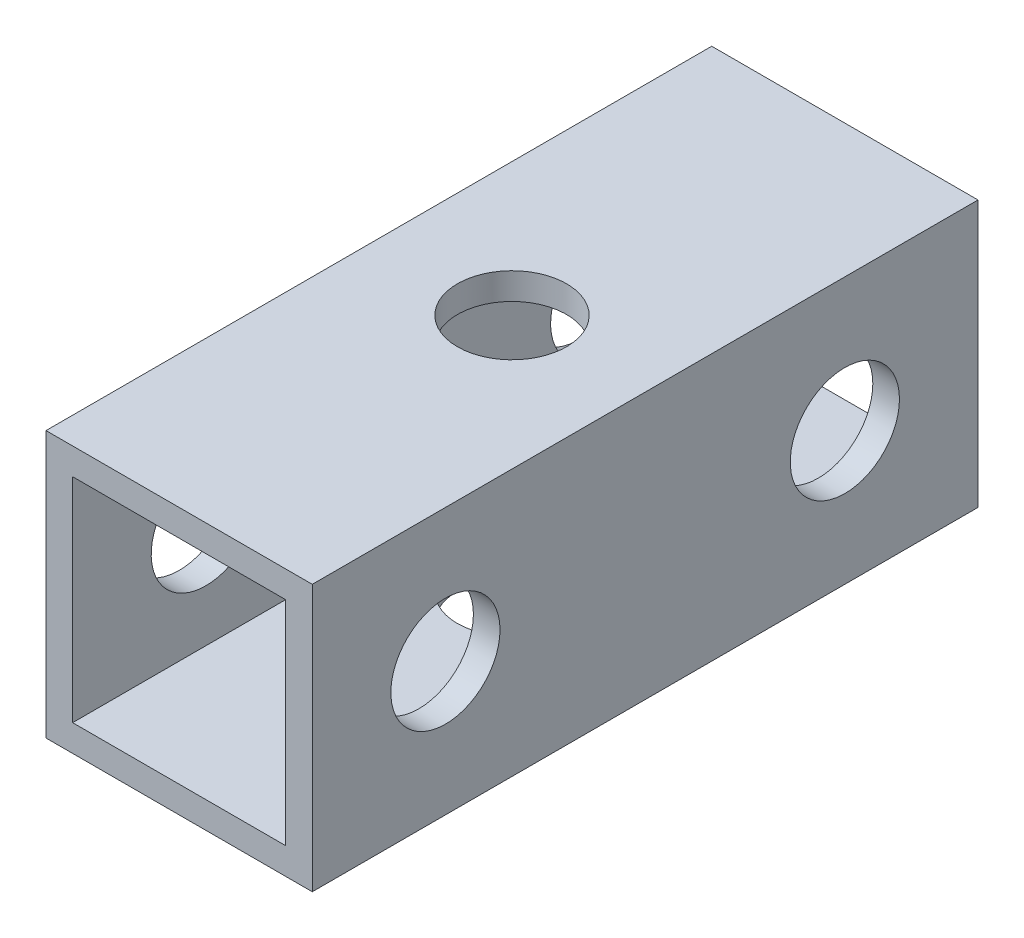
ISO-10303-21;
HEADER;
FILE_DESCRIPTION(('STEP AP214'),'2;1');
FILE_NAME('part.step','',(''),(''),'','','');
FILE_SCHEMA(('AUTOMOTIVE_DESIGN { 1 0 10303 214 1 1 1 1 }'));
ENDSEC;
DATA;
#1=APPLICATION_CONTEXT('core data for automotive mechanical design processes');
#2=APPLICATION_PROTOCOL_DEFINITION('international standard','automotive_design',2000,#1);
#3=PRODUCT_CONTEXT('',#1,'mechanical');
#4=PRODUCT('Part','Part','',(#3));
#5=PRODUCT_RELATED_PRODUCT_CATEGORY('part','',(#4));
#6=PRODUCT_DEFINITION_FORMATION('','',#4);
#7=PRODUCT_DEFINITION_CONTEXT('part definition',#1,'design');
#8=PRODUCT_DEFINITION('design','',#6,#7);
#9=PRODUCT_DEFINITION_SHAPE('','',#8);
#10=(LENGTH_UNIT() NAMED_UNIT(*) SI_UNIT(.MILLI.,.METRE.));
#11=(NAMED_UNIT(*) PLANE_ANGLE_UNIT() SI_UNIT($,.RADIAN.));
#12=(NAMED_UNIT(*) SI_UNIT($,.STERADIAN.) SOLID_ANGLE_UNIT());
#13=UNCERTAINTY_MEASURE_WITH_UNIT(LENGTH_MEASURE(1.E-05),#10,'distance_accuracy_value','');
#14=(GEOMETRIC_REPRESENTATION_CONTEXT(3) GLOBAL_UNCERTAINTY_ASSIGNED_CONTEXT((#13)) GLOBAL_UNIT_ASSIGNED_CONTEXT((#10,
#11,#12)) REPRESENTATION_CONTEXT('',''));
#15=CARTESIAN_POINT('',(0.,0.,0.));
#16=DIRECTION('',(0.,0.,1.));
#17=DIRECTION('',(1.,0.,0.));
#18=AXIS2_PLACEMENT_3D('',#15,#16,#17);
#19=CARTESIAN_POINT('',(0.,0.,12.5));
#20=DIRECTION('',(0.,0.,-1.));
#21=DIRECTION('',(-1.,0.,0.));
#22=AXIS2_PLACEMENT_3D('',#19,#20,#21);
#23=PLANE('',#22);
#24=DIRECTION('',(1.,0.,0.));
#25=VECTOR('',#24,1.);
#26=CARTESIAN_POINT('',(5.,-5.,12.5));
#27=LINE('',#26,#25);
#28=CARTESIAN_POINT('',(-5.,-5.,12.5));
#29=VERTEX_POINT('',#28);
#30=CARTESIAN_POINT('',(5.,-5.,12.5));
#31=VERTEX_POINT('',#30);
#32=EDGE_CURVE('E139',#29,#31,#27,.T.);
#33=ORIENTED_EDGE('',*,*,#32,.T.);
#34=DIRECTION('',(0.,1.,0.));
#35=VECTOR('',#34,1.);
#36=CARTESIAN_POINT('',(5.,-5.,12.5));
#37=LINE('',#36,#35);
#38=CARTESIAN_POINT('',(5.,5.,12.5));
#39=VERTEX_POINT('',#38);
#40=EDGE_CURVE('E142',#31,#39,#37,.T.);
#41=ORIENTED_EDGE('',*,*,#40,.T.);
#42=DIRECTION('',(-1.,0.,0.));
#43=VECTOR('',#42,1.);
#44=CARTESIAN_POINT('',(5.,5.,12.5));
#45=LINE('',#44,#43);
#46=CARTESIAN_POINT('',(-5.,5.,12.5));
#47=VERTEX_POINT('',#46);
#48=EDGE_CURVE('E145',#39,#47,#45,.T.);
#49=ORIENTED_EDGE('',*,*,#48,.T.);
#50=DIRECTION('',(0.,-1.,0.));
#51=VECTOR('',#50,1.);
#52=CARTESIAN_POINT('',(-5.,-5.,12.5));
#53=LINE('',#52,#51);
#54=EDGE_CURVE('E147',#47,#29,#53,.T.);
#55=ORIENTED_EDGE('',*,*,#54,.T.);
#56=EDGE_LOOP('',(#33,#41,#49,#55));
#57=FACE_BOUND('',#56,.T.);
#58=DIRECTION('',(0.,-1.,0.));
#59=VECTOR('',#58,1.);
#60=CARTESIAN_POINT('',(-4.,-4.,12.5));
#61=LINE('',#60,#59);
#62=CARTESIAN_POINT('',(-3.99999999999999,4.,12.5));
#63=VERTEX_POINT('',#62);
#64=CARTESIAN_POINT('',(-4.,-4.,12.5));
#65=VERTEX_POINT('',#64);
#66=EDGE_CURVE('E101',#63,#65,#61,.T.);
#67=ORIENTED_EDGE('',*,*,#66,.F.);
#68=DIRECTION('',(-1.,0.,0.));
#69=VECTOR('',#68,1.);
#70=CARTESIAN_POINT('',(4.,4.,12.5));
#71=LINE('',#70,#69);
#72=CARTESIAN_POINT('',(4.,4.,12.5));
#73=VERTEX_POINT('',#72);
#74=EDGE_CURVE('E123',#73,#63,#71,.T.);
#75=ORIENTED_EDGE('',*,*,#74,.F.);
#76=DIRECTION('',(0.,1.,0.));
#77=VECTOR('',#76,1.);
#78=CARTESIAN_POINT('',(4.,-3.99999999999999,12.5));
#79=LINE('',#78,#77);
#80=CARTESIAN_POINT('',(4.,-3.99999999999999,12.5));
#81=VERTEX_POINT('',#80);
#82=EDGE_CURVE('E121',#81,#73,#79,.T.);
#83=ORIENTED_EDGE('',*,*,#82,.F.);
#84=DIRECTION('',(1.,0.,0.));
#85=VECTOR('',#84,1.);
#86=CARTESIAN_POINT('',(4.,-3.99999999999999,12.5));
#87=LINE('',#86,#85);
#88=EDGE_CURVE('E109',#65,#81,#87,.T.);
#89=ORIENTED_EDGE('',*,*,#88,.F.);
#90=EDGE_LOOP('',(#67,#75,#83,#89));
#91=FACE_BOUND('',#90,.T.);
#92=ADVANCED_FACE('F34',(#57,#91),#23,.F.);
#93=CARTESIAN_POINT('',(0.,0.,-12.5));
#94=DIRECTION('',(0.,0.,-1.));
#95=DIRECTION('',(-1.,0.,0.));
#96=AXIS2_PLACEMENT_3D('',#93,#94,#95);
#97=PLANE('',#96);
#98=DIRECTION('',(1.,0.,0.));
#99=VECTOR('',#98,1.);
#100=CARTESIAN_POINT('',(5.,-5.,-12.5));
#101=LINE('',#100,#99);
#102=CARTESIAN_POINT('',(-5.,-5.,-12.5));
#103=VERTEX_POINT('',#102);
#104=CARTESIAN_POINT('',(5.,-5.,-12.5));
#105=VERTEX_POINT('',#104);
#106=EDGE_CURVE('E117',#103,#105,#101,.T.);
#107=ORIENTED_EDGE('',*,*,#106,.F.);
#108=DIRECTION('',(0.,-1.,0.));
#109=VECTOR('',#108,1.);
#110=CARTESIAN_POINT('',(-5.,-5.,-12.5));
#111=LINE('',#110,#109);
#112=CARTESIAN_POINT('',(-5.,5.,-12.5));
#113=VERTEX_POINT('',#112);
#114=EDGE_CURVE('E143',#113,#103,#111,.T.);
#115=ORIENTED_EDGE('',*,*,#114,.F.);
#116=DIRECTION('',(-1.,0.,0.));
#117=VECTOR('',#116,1.);
#118=CARTESIAN_POINT('',(5.,5.,-12.5));
#119=LINE('',#118,#117);
#120=CARTESIAN_POINT('',(5.,5.,-12.5));
#121=VERTEX_POINT('',#120);
#122=EDGE_CURVE('E154',#121,#113,#119,.T.);
#123=ORIENTED_EDGE('',*,*,#122,.F.);
#124=DIRECTION('',(0.,1.,0.));
#125=VECTOR('',#124,1.);
#126=CARTESIAN_POINT('',(5.,-5.,-12.5));
#127=LINE('',#126,#125);
#128=EDGE_CURVE('E152',#105,#121,#127,.T.);
#129=ORIENTED_EDGE('',*,*,#128,.F.);
#130=EDGE_LOOP('',(#107,#115,#123,#129));
#131=FACE_BOUND('',#130,.T.);
#132=DIRECTION('',(-1.,0.,0.));
#133=VECTOR('',#132,1.);
#134=CARTESIAN_POINT('',(4.,4.,-12.5));
#135=LINE('',#134,#133);
#136=CARTESIAN_POINT('',(4.,4.,-12.5));
#137=VERTEX_POINT('',#136);
#138=CARTESIAN_POINT('',(-3.99999999999999,4.,-12.5));
#139=VERTEX_POINT('',#138);
#140=EDGE_CURVE('E110',#137,#139,#135,.T.);
#141=ORIENTED_EDGE('',*,*,#140,.T.);
#142=DIRECTION('',(0.,-1.,0.));
#143=VECTOR('',#142,1.);
#144=CARTESIAN_POINT('',(-4.,-4.,-12.5));
#145=LINE('',#144,#143);
#146=CARTESIAN_POINT('',(-4.,-4.,-12.5));
#147=VERTEX_POINT('',#146);
#148=EDGE_CURVE('E59',#139,#147,#145,.T.);
#149=ORIENTED_EDGE('',*,*,#148,.T.);
#150=DIRECTION('',(1.,0.,0.));
#151=VECTOR('',#150,1.);
#152=CARTESIAN_POINT('',(4.,-3.99999999999999,-12.5));
#153=LINE('',#152,#151);
#154=CARTESIAN_POINT('',(4.,-3.99999999999999,-12.5));
#155=VERTEX_POINT('',#154);
#156=EDGE_CURVE('E116',#147,#155,#153,.T.);
#157=ORIENTED_EDGE('',*,*,#156,.T.);
#158=DIRECTION('',(0.,1.,0.));
#159=VECTOR('',#158,1.);
#160=CARTESIAN_POINT('',(4.,-3.99999999999999,-12.5));
#161=LINE('',#160,#159);
#162=EDGE_CURVE('E131',#155,#137,#161,.T.);
#163=ORIENTED_EDGE('',*,*,#162,.T.);
#164=EDGE_LOOP('',(#141,#149,#157,#163));
#165=FACE_BOUND('',#164,.T.);
#166=ADVANCED_FACE('F216',(#131,#165),#97,.T.);
#167=CARTESIAN_POINT('',(5.,-5.,12.5));
#168=DIRECTION('',(0.,1.,0.));
#169=DIRECTION('',(0.,0.,1.));
#170=AXIS2_PLACEMENT_3D('',#167,#168,#169);
#171=PLANE('',#170);
#172=CARTESIAN_POINT('',(0.,-5.,0.));
#173=DIRECTION('',(0.,1.,0.));
#174=DIRECTION('',(0.,0.,1.));
#175=AXIS2_PLACEMENT_3D('',#172,#173,#174);
#176=CIRCLE('',#175,2.05);
#177=CARTESIAN_POINT('',(0.,-5.,2.05));
#178=VERTEX_POINT('',#177);
#179=EDGE_CURVE('E166',#178,#178,#176,.T.);
#180=ORIENTED_EDGE('',*,*,#179,.T.);
#181=EDGE_LOOP('',(#180));
#182=FACE_BOUND('',#181,.T.);
#183=ORIENTED_EDGE('',*,*,#106,.T.);
#184=DIRECTION('',(0.,0.,-1.));
#185=VECTOR('',#184,1.);
#186=CARTESIAN_POINT('',(5.,-5.,12.5));
#187=LINE('',#186,#185);
#188=EDGE_CURVE('E11',#31,#105,#187,.T.);
#189=ORIENTED_EDGE('',*,*,#188,.F.);
#190=ORIENTED_EDGE('',*,*,#32,.F.);
#191=DIRECTION('',(0.,0.,-1.));
#192=VECTOR('',#191,1.);
#193=CARTESIAN_POINT('',(-5.,-5.,12.5));
#194=LINE('',#193,#192);
#195=EDGE_CURVE('E149',#29,#103,#194,.T.);
#196=ORIENTED_EDGE('',*,*,#195,.T.);
#197=EDGE_LOOP('',(#183,#189,#190,#196));
#198=FACE_BOUND('',#197,.T.);
#199=ADVANCED_FACE('F36',(#182,#198),#171,.F.);
#200=CARTESIAN_POINT('',(5.,-5.,12.5));
#201=DIRECTION('',(-1.,0.,0.));
#202=DIRECTION('',(0.,0.,1.));
#203=AXIS2_PLACEMENT_3D('',#200,#201,#202);
#204=PLANE('',#203);
#205=CARTESIAN_POINT('',(5.,0.,7.5));
#206=DIRECTION('',(1.,0.,0.));
#207=DIRECTION('',(0.,0.,-1.));
#208=AXIS2_PLACEMENT_3D('',#205,#206,#207);
#209=CIRCLE('',#208,2.05);
#210=CARTESIAN_POINT('',(5.,0.,5.45));
#211=VERTEX_POINT('',#210);
#212=EDGE_CURVE('E176',#211,#211,#209,.T.);
#213=ORIENTED_EDGE('',*,*,#212,.F.);
#214=EDGE_LOOP('',(#213));
#215=FACE_BOUND('',#214,.T.);
#216=CARTESIAN_POINT('',(5.,0.,-7.5));
#217=DIRECTION('',(1.,0.,0.));
#218=DIRECTION('',(0.,0.,-1.));
#219=AXIS2_PLACEMENT_3D('',#216,#217,#218);
#220=CIRCLE('',#219,2.05);
#221=CARTESIAN_POINT('',(5.,0.,-9.55));
#222=VERTEX_POINT('',#221);
#223=EDGE_CURVE('E186',#222,#222,#220,.T.);
#224=ORIENTED_EDGE('',*,*,#223,.F.);
#225=EDGE_LOOP('',(#224));
#226=FACE_BOUND('',#225,.T.);
#227=ORIENTED_EDGE('',*,*,#128,.T.);
#228=DIRECTION('',(0.,0.,-1.));
#229=VECTOR('',#228,1.);
#230=CARTESIAN_POINT('',(5.,5.,12.5));
#231=LINE('',#230,#229);
#232=EDGE_CURVE('E43',#39,#121,#231,.T.);
#233=ORIENTED_EDGE('',*,*,#232,.F.);
#234=ORIENTED_EDGE('',*,*,#40,.F.);
#235=ORIENTED_EDGE('',*,*,#188,.T.);
#236=EDGE_LOOP('',(#227,#233,#234,#235));
#237=FACE_BOUND('',#236,.T.);
#238=ADVANCED_FACE('F229',(#215,#226,#237),#204,.F.);
#239=CARTESIAN_POINT('',(5.,5.,12.5));
#240=DIRECTION('',(0.,-1.,0.));
#241=DIRECTION('',(0.,0.,-1.));
#242=AXIS2_PLACEMENT_3D('',#239,#240,#241);
#243=PLANE('',#242);
#244=CARTESIAN_POINT('',(0.,5.,0.));
#245=DIRECTION('',(0.,1.,0.));
#246=DIRECTION('',(0.,0.,1.));
#247=AXIS2_PLACEMENT_3D('',#244,#245,#246);
#248=CIRCLE('',#247,2.05);
#249=CARTESIAN_POINT('',(0.,5.,2.05));
#250=VERTEX_POINT('',#249);
#251=EDGE_CURVE('E192',#250,#250,#248,.T.);
#252=ORIENTED_EDGE('',*,*,#251,.F.);
#253=EDGE_LOOP('',(#252));
#254=FACE_BOUND('',#253,.T.);
#255=ORIENTED_EDGE('',*,*,#122,.T.);
#256=DIRECTION('',(0.,0.,-1.));
#257=VECTOR('',#256,1.);
#258=CARTESIAN_POINT('',(-5.,5.,12.5));
#259=LINE('',#258,#257);
#260=EDGE_CURVE('E159',#47,#113,#259,.T.);
#261=ORIENTED_EDGE('',*,*,#260,.F.);
#262=ORIENTED_EDGE('',*,*,#48,.F.);
#263=ORIENTED_EDGE('',*,*,#232,.T.);
#264=EDGE_LOOP('',(#255,#261,#262,#263));
#265=FACE_BOUND('',#264,.T.);
#266=ADVANCED_FACE('F227',(#254,#265),#243,.F.);
#267=CARTESIAN_POINT('',(-5.,-5.,12.5));
#268=DIRECTION('',(1.,0.,0.));
#269=DIRECTION('',(0.,0.,-1.));
#270=AXIS2_PLACEMENT_3D('',#267,#268,#269);
#271=PLANE('',#270);
#272=CARTESIAN_POINT('',(-5.,0.,7.5));
#273=DIRECTION('',(1.,0.,0.));
#274=DIRECTION('',(0.,0.,-1.));
#275=AXIS2_PLACEMENT_3D('',#272,#273,#274);
#276=CIRCLE('',#275,2.05);
#277=CARTESIAN_POINT('',(-5.,0.,5.45));
#278=VERTEX_POINT('',#277);
#279=EDGE_CURVE('E170',#278,#278,#276,.T.);
#280=ORIENTED_EDGE('',*,*,#279,.T.);
#281=EDGE_LOOP('',(#280));
#282=FACE_BOUND('',#281,.T.);
#283=CARTESIAN_POINT('',(-5.,0.,-7.5));
#284=DIRECTION('',(1.,0.,0.));
#285=DIRECTION('',(0.,0.,-1.));
#286=AXIS2_PLACEMENT_3D('',#283,#284,#285);
#287=CIRCLE('',#286,2.05);
#288=CARTESIAN_POINT('',(-5.,0.,-9.55));
#289=VERTEX_POINT('',#288);
#290=EDGE_CURVE('E181',#289,#289,#287,.T.);
#291=ORIENTED_EDGE('',*,*,#290,.T.);
#292=EDGE_LOOP('',(#291));
#293=FACE_BOUND('',#292,.T.);
#294=ORIENTED_EDGE('',*,*,#114,.T.);
#295=ORIENTED_EDGE('',*,*,#195,.F.);
#296=ORIENTED_EDGE('',*,*,#54,.F.);
#297=ORIENTED_EDGE('',*,*,#260,.T.);
#298=EDGE_LOOP('',(#294,#295,#296,#297));
#299=FACE_BOUND('',#298,.T.);
#300=ADVANCED_FACE('F212',(#282,#293,#299),#271,.F.);
#301=CARTESIAN_POINT('',(-4.,-4.,12.5));
#302=DIRECTION('',(1.,0.,0.));
#303=DIRECTION('',(0.,1.,0.));
#304=AXIS2_PLACEMENT_3D('',#301,#302,#303);
#305=PLANE('',#304);
#306=CARTESIAN_POINT('',(-4.,0.,7.5));
#307=DIRECTION('',(1.,0.,0.));
#308=DIRECTION('',(0.,1.,0.));
#309=AXIS2_PLACEMENT_3D('',#306,#307,#308);
#310=CIRCLE('',#309,2.05);
#311=CARTESIAN_POINT('',(-4.,2.05,7.5));
#312=VERTEX_POINT('',#311);
#313=EDGE_CURVE('E189',#312,#312,#310,.T.);
#314=ORIENTED_EDGE('',*,*,#313,.F.);
#315=EDGE_LOOP('',(#314));
#316=FACE_BOUND('',#315,.T.);
#317=CARTESIAN_POINT('',(-4.,0.,-7.5));
#318=DIRECTION('',(1.,0.,0.));
#319=DIRECTION('',(0.,1.,0.));
#320=AXIS2_PLACEMENT_3D('',#317,#318,#319);
#321=CIRCLE('',#320,2.05);
#322=CARTESIAN_POINT('',(-4.,2.05,-7.5));
#323=VERTEX_POINT('',#322);
#324=EDGE_CURVE('E169',#323,#323,#321,.T.);
#325=ORIENTED_EDGE('',*,*,#324,.F.);
#326=EDGE_LOOP('',(#325));
#327=FACE_BOUND('',#326,.T.);
#328=ORIENTED_EDGE('',*,*,#148,.F.);
#329=DIRECTION('',(0.,0.,-1.));
#330=VECTOR('',#329,1.);
#331=CARTESIAN_POINT('',(-3.99999999999999,4.,12.5));
#332=LINE('',#331,#330);
#333=EDGE_CURVE('E105',#63,#139,#332,.T.);
#334=ORIENTED_EDGE('',*,*,#333,.F.);
#335=ORIENTED_EDGE('',*,*,#66,.T.);
#336=DIRECTION('',(0.,0.,-1.));
#337=VECTOR('',#336,1.);
#338=CARTESIAN_POINT('',(-4.,-4.,12.5));
#339=LINE('',#338,#337);
#340=EDGE_CURVE('E104',#65,#147,#339,.T.);
#341=ORIENTED_EDGE('',*,*,#340,.T.);
#342=EDGE_LOOP('',(#328,#334,#335,#341));
#343=FACE_BOUND('',#342,.T.);
#344=ADVANCED_FACE('F103',(#316,#327,#343),#305,.T.);
#345=CARTESIAN_POINT('',(4.,-3.99999999999999,12.5));
#346=DIRECTION('',(0.,1.,0.));
#347=DIRECTION('',(-1.,0.,0.));
#348=AXIS2_PLACEMENT_3D('',#345,#346,#347);
#349=PLANE('',#348);
#350=CARTESIAN_POINT('',(0.,-4.,0.));
#351=DIRECTION('',(0.,1.,0.));
#352=DIRECTION('',(-1.,0.,0.));
#353=AXIS2_PLACEMENT_3D('',#350,#351,#352);
#354=CIRCLE('',#353,2.05);
#355=CARTESIAN_POINT('',(-2.05,-4.,0.));
#356=VERTEX_POINT('',#355);
#357=EDGE_CURVE('E129',#356,#356,#354,.T.);
#358=ORIENTED_EDGE('',*,*,#357,.F.);
#359=EDGE_LOOP('',(#358));
#360=FACE_BOUND('',#359,.T.);
#361=ORIENTED_EDGE('',*,*,#156,.F.);
#362=ORIENTED_EDGE('',*,*,#340,.F.);
#363=ORIENTED_EDGE('',*,*,#88,.T.);
#364=DIRECTION('',(0.,0.,-1.));
#365=VECTOR('',#364,1.);
#366=CARTESIAN_POINT('',(4.,-3.99999999999999,12.5));
#367=LINE('',#366,#365);
#368=EDGE_CURVE('E118',#81,#155,#367,.T.);
#369=ORIENTED_EDGE('',*,*,#368,.T.);
#370=EDGE_LOOP('',(#361,#362,#363,#369));
#371=FACE_BOUND('',#370,.T.);
#372=ADVANCED_FACE('F113',(#360,#371),#349,.T.);
#373=CARTESIAN_POINT('',(4.,-3.99999999999999,12.5));
#374=DIRECTION('',(-1.,0.,0.));
#375=DIRECTION('',(0.,0.,1.));
#376=AXIS2_PLACEMENT_3D('',#373,#374,#375);
#377=PLANE('',#376);
#378=CARTESIAN_POINT('',(4.,0.,7.5));
#379=DIRECTION('',(-1.,0.,0.));
#380=DIRECTION('',(0.,0.,1.));
#381=AXIS2_PLACEMENT_3D('',#378,#379,#380);
#382=CIRCLE('',#381,2.05);
#383=CARTESIAN_POINT('',(4.,0.,9.55));
#384=VERTEX_POINT('',#383);
#385=EDGE_CURVE('E38',#384,#384,#382,.T.);
#386=ORIENTED_EDGE('',*,*,#385,.F.);
#387=EDGE_LOOP('',(#386));
#388=FACE_BOUND('',#387,.T.);
#389=CARTESIAN_POINT('',(4.,0.,-7.5));
#390=DIRECTION('',(-1.,0.,0.));
#391=DIRECTION('',(0.,0.,1.));
#392=AXIS2_PLACEMENT_3D('',#389,#390,#391);
#393=CIRCLE('',#392,2.05);
#394=CARTESIAN_POINT('',(4.,0.,-5.45));
#395=VERTEX_POINT('',#394);
#396=EDGE_CURVE('E167',#395,#395,#393,.T.);
#397=ORIENTED_EDGE('',*,*,#396,.F.);
#398=EDGE_LOOP('',(#397));
#399=FACE_BOUND('',#398,.T.);
#400=ORIENTED_EDGE('',*,*,#162,.F.);
#401=ORIENTED_EDGE('',*,*,#368,.F.);
#402=ORIENTED_EDGE('',*,*,#82,.T.);
#403=DIRECTION('',(0.,0.,-1.));
#404=VECTOR('',#403,1.);
#405=CARTESIAN_POINT('',(4.,4.,12.5));
#406=LINE('',#405,#404);
#407=EDGE_CURVE('E51',#73,#137,#406,.T.);
#408=ORIENTED_EDGE('',*,*,#407,.T.);
#409=EDGE_LOOP('',(#400,#401,#402,#408));
#410=FACE_BOUND('',#409,.T.);
#411=ADVANCED_FACE('F203',(#388,#399,#410),#377,.T.);
#412=CARTESIAN_POINT('',(4.,4.,12.5));
#413=DIRECTION('',(0.,-1.,0.));
#414=DIRECTION('',(1.,0.,0.));
#415=AXIS2_PLACEMENT_3D('',#412,#413,#414);
#416=PLANE('',#415);
#417=CARTESIAN_POINT('',(0.,4.,0.));
#418=DIRECTION('',(0.,-1.,0.));
#419=DIRECTION('',(1.,0.,0.));
#420=AXIS2_PLACEMENT_3D('',#417,#418,#419);
#421=CIRCLE('',#420,2.05);
#422=CARTESIAN_POINT('',(2.05,4.,0.));
#423=VERTEX_POINT('',#422);
#424=EDGE_CURVE('E164',#423,#423,#421,.T.);
#425=ORIENTED_EDGE('',*,*,#424,.F.);
#426=EDGE_LOOP('',(#425));
#427=FACE_BOUND('',#426,.T.);
#428=ORIENTED_EDGE('',*,*,#140,.F.);
#429=ORIENTED_EDGE('',*,*,#407,.F.);
#430=ORIENTED_EDGE('',*,*,#74,.T.);
#431=ORIENTED_EDGE('',*,*,#333,.T.);
#432=EDGE_LOOP('',(#428,#429,#430,#431));
#433=FACE_BOUND('',#432,.T.);
#434=ADVANCED_FACE('F209',(#427,#433),#416,.T.);
#435=CARTESIAN_POINT('',(0.,-5.,0.));
#436=DIRECTION('',(0.,1.,0.));
#437=DIRECTION('',(0.,0.,1.));
#438=AXIS2_PLACEMENT_3D('',#435,#436,#437);
#439=CYLINDRICAL_SURFACE('',#438,2.05);
#440=ORIENTED_EDGE('',*,*,#424,.T.);
#441=EDGE_LOOP('',(#440));
#442=FACE_BOUND('',#441,.T.);
#443=ORIENTED_EDGE('',*,*,#251,.T.);
#444=EDGE_LOOP('',(#443));
#445=FACE_BOUND('',#444,.T.);
#446=ADVANCED_FACE('F257',(#442,#445),#439,.F.);
#447=ORIENTED_EDGE('',*,*,#357,.T.);
#448=EDGE_LOOP('',(#447));
#449=FACE_BOUND('',#448,.T.);
#450=ORIENTED_EDGE('',*,*,#179,.F.);
#451=EDGE_LOOP('',(#450));
#452=FACE_BOUND('',#451,.T.);
#453=ADVANCED_FACE('F199',(#449,#452),#439,.F.);
#454=CARTESIAN_POINT('',(-5.,0.,-7.5));
#455=DIRECTION('',(1.,0.,0.));
#456=DIRECTION('',(0.,0.,-1.));
#457=AXIS2_PLACEMENT_3D('',#454,#455,#456);
#458=CYLINDRICAL_SURFACE('',#457,2.05);
#459=ORIENTED_EDGE('',*,*,#396,.T.);
#460=EDGE_LOOP('',(#459));
#461=FACE_BOUND('',#460,.T.);
#462=ORIENTED_EDGE('',*,*,#223,.T.);
#463=EDGE_LOOP('',(#462));
#464=FACE_BOUND('',#463,.T.);
#465=ADVANCED_FACE('F267',(#461,#464),#458,.F.);
#466=CARTESIAN_POINT('',(-5.,0.,7.5));
#467=DIRECTION('',(1.,0.,0.));
#468=DIRECTION('',(0.,0.,-1.));
#469=AXIS2_PLACEMENT_3D('',#466,#467,#468);
#470=CYLINDRICAL_SURFACE('',#469,2.05);
#471=ORIENTED_EDGE('',*,*,#385,.T.);
#472=EDGE_LOOP('',(#471));
#473=FACE_BOUND('',#472,.T.);
#474=ORIENTED_EDGE('',*,*,#212,.T.);
#475=EDGE_LOOP('',(#474));
#476=FACE_BOUND('',#475,.T.);
#477=ADVANCED_FACE('F270',(#473,#476),#470,.F.);
#478=ORIENTED_EDGE('',*,*,#324,.T.);
#479=EDGE_LOOP('',(#478));
#480=FACE_BOUND('',#479,.T.);
#481=ORIENTED_EDGE('',*,*,#290,.F.);
#482=EDGE_LOOP('',(#481));
#483=FACE_BOUND('',#482,.T.);
#484=ADVANCED_FACE('F271',(#480,#483),#458,.F.);
#485=ORIENTED_EDGE('',*,*,#313,.T.);
#486=EDGE_LOOP('',(#485));
#487=FACE_BOUND('',#486,.T.);
#488=ORIENTED_EDGE('',*,*,#279,.F.);
#489=EDGE_LOOP('',(#488));
#490=FACE_BOUND('',#489,.T.);
#491=ADVANCED_FACE('F274',(#487,#490),#470,.F.);
#492=CLOSED_SHELL('',(#92,#166,#199,#238,#266,#300,#344,#372,#411,#434,#446,#453,#465,#477,#484,#491));
#493=MANIFOLD_SOLID_BREP('B2',#492);
#494=ADVANCED_BREP_SHAPE_REPRESENTATION('',(#18,#493),#14);
#495=SHAPE_DEFINITION_REPRESENTATION(#9,#494);
ENDSEC;
END-ISO-10303-21;
